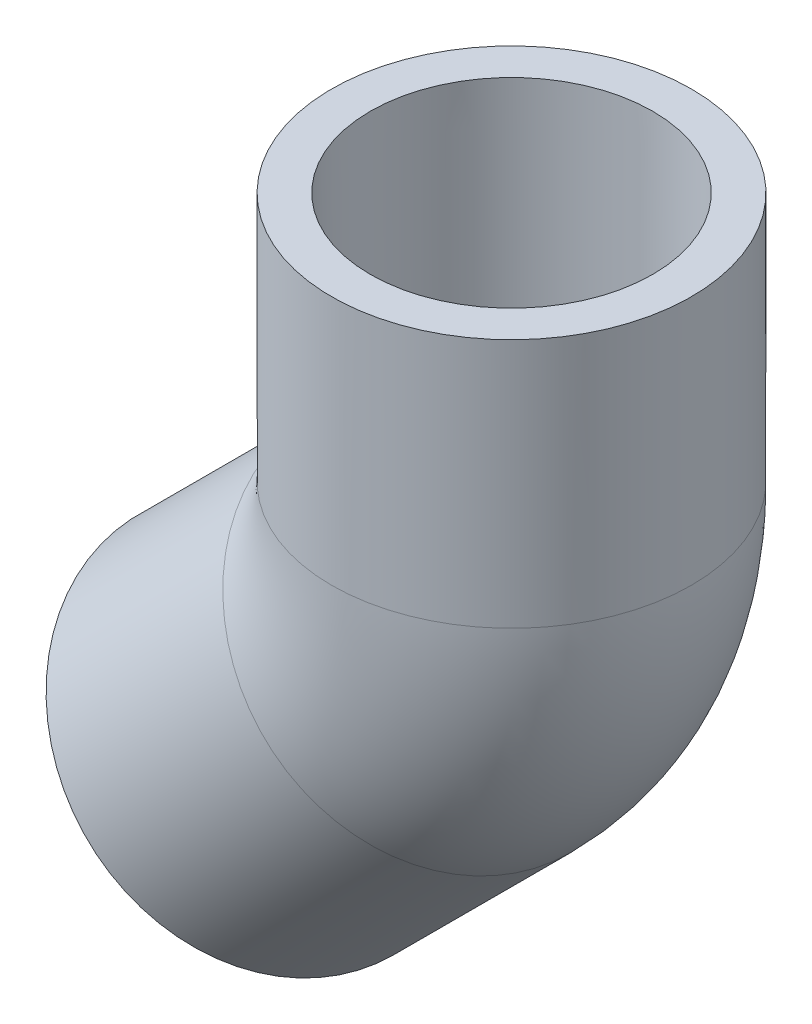
ISO-10303-21;
HEADER;
FILE_DESCRIPTION(('STEP AP214'),'2;1');
FILE_NAME('part.step','',(''),(''),'','','');
FILE_SCHEMA(('AUTOMOTIVE_DESIGN { 1 0 10303 214 1 1 1 1 }'));
ENDSEC;
DATA;
#1=APPLICATION_CONTEXT('core data for automotive mechanical design processes');
#2=APPLICATION_PROTOCOL_DEFINITION('international standard','automotive_design',2000,#1);
#3=PRODUCT_CONTEXT('',#1,'mechanical');
#4=PRODUCT('Part','Part','',(#3));
#5=PRODUCT_RELATED_PRODUCT_CATEGORY('part','',(#4));
#6=PRODUCT_DEFINITION_FORMATION('','',#4);
#7=PRODUCT_DEFINITION_CONTEXT('part definition',#1,'design');
#8=PRODUCT_DEFINITION('design','',#6,#7);
#9=PRODUCT_DEFINITION_SHAPE('','',#8);
#10=(LENGTH_UNIT() NAMED_UNIT(*) SI_UNIT(.MILLI.,.METRE.));
#11=(NAMED_UNIT(*) PLANE_ANGLE_UNIT() SI_UNIT($,.RADIAN.));
#12=(NAMED_UNIT(*) SI_UNIT($,.STERADIAN.) SOLID_ANGLE_UNIT());
#13=UNCERTAINTY_MEASURE_WITH_UNIT(LENGTH_MEASURE(1.E-05),#10,'distance_accuracy_value','');
#14=(GEOMETRIC_REPRESENTATION_CONTEXT(3) GLOBAL_UNCERTAINTY_ASSIGNED_CONTEXT((#13)) GLOBAL_UNIT_ASSIGNED_CONTEXT((#10,
#11,#12)) REPRESENTATION_CONTEXT('',''));
#15=CARTESIAN_POINT('',(0.,0.,0.));
#16=DIRECTION('',(0.,0.,1.));
#17=DIRECTION('',(1.,0.,0.));
#18=AXIS2_PLACEMENT_3D('',#15,#16,#17);
#19=CARTESIAN_POINT('',(-8.9802561210692,-28.3776093425785,0.));
#20=DIRECTION('',(-0.707106781186549,-0.707106781186546,0.));
#21=DIRECTION('',(0.707106781186546,-0.707106781186549,0.));
#22=AXIS2_PLACEMENT_3D('',#19,#20,#21);
#23=PLANE('',#22);
#24=CARTESIAN_POINT('',(-18.6789327318239,-18.6789327318238,0.));
#25=DIRECTION('',(-0.707106781186549,-0.707106781186546,0.));
#26=DIRECTION('',(0.707106781186546,-0.707106781186549,0.));
#27=AXIS2_PLACEMENT_3D('',#24,#25,#26);
#28=CIRCLE('',#27,13.716);
#29=CARTESIAN_POINT('',(-8.9802561210692,-28.3776093425785,0.));
#30=VERTEX_POINT('',#29);
#31=EDGE_CURVE('E49',#30,#30,#28,.T.);
#32=ORIENTED_EDGE('',*,*,#31,.T.);
#33=EDGE_LOOP('',(#32));
#34=FACE_BOUND('',#33,.T.);
#35=CARTESIAN_POINT('',(-18.6789327318239,-18.6789327318238,0.));
#36=DIRECTION('',(-0.707106781186549,-0.707106781186546,0.));
#37=DIRECTION('',(0.707106781186546,-0.707106781186549,0.));
#38=AXIS2_PLACEMENT_3D('',#35,#36,#37);
#39=CIRCLE('',#38,10.7696);
#40=CARTESIAN_POINT('',(-11.0636755411572,-26.2941899224905,0.));
#41=VERTEX_POINT('',#40);
#42=EDGE_CURVE('E36',#41,#41,#39,.T.);
#43=ORIENTED_EDGE('',*,*,#42,.F.);
#44=EDGE_LOOP('',(#43));
#45=FACE_BOUND('',#44,.T.);
#46=ADVANCED_FACE('F30',(#34,#45),#23,.T.);
#47=CARTESIAN_POINT('',(-5.20854855022012,-5.2085485502201,0.));
#48=DIRECTION('',(-0.707106781186549,-0.707106781186546,0.));
#49=DIRECTION('',(0.707106781186546,-0.707106781186549,0.));
#50=AXIS2_PLACEMENT_3D('',#47,#48,#49);
#51=CONICAL_SURFACE('',#50,10.6172,0.00799982933988657);
#52=ORIENTED_EDGE('',*,*,#42,.T.);
#53=EDGE_LOOP('',(#52));
#54=FACE_BOUND('',#53,.T.);
#55=CARTESIAN_POINT('',(-5.20854855022012,-5.2085485502201,0.));
#56=DIRECTION('',(-0.707106781186549,-0.707106781186546,0.));
#57=DIRECTION('',(0.707106781186546,-0.707106781186549,0.));
#58=AXIS2_PLACEMENT_3D('',#55,#56,#57);
#59=CIRCLE('',#58,10.6172);
#60=CARTESIAN_POINT('',(2.29894556699368,-12.7160426674339,0.));
#61=VERTEX_POINT('',#60);
#62=EDGE_CURVE('E40',#61,#61,#59,.T.);
#63=ORIENTED_EDGE('',*,*,#62,.F.);
#64=EDGE_LOOP('',(#63));
#65=FACE_BOUND('',#64,.T.);
#66=ADVANCED_FACE('F81',(#54,#65),#51,.F.);
#67=CARTESIAN_POINT('',(-18.6789327318239,-18.6789327318238,0.));
#68=DIRECTION('',(-0.707106781186549,-0.707106781186546,0.));
#69=DIRECTION('',(0.707106781186546,-0.707106781186549,0.));
#70=AXIS2_PLACEMENT_3D('',#67,#68,#69);
#71=CYLINDRICAL_SURFACE('',#70,13.716);
#72=CARTESIAN_POINT('',(-5.20854855022012,-5.2085485502201,0.));
#73=DIRECTION('',(-0.707106781186549,-0.707106781186546,0.));
#74=DIRECTION('',(0.707106781186546,-0.707106781186549,0.));
#75=AXIS2_PLACEMENT_3D('',#72,#73,#74);
#76=CIRCLE('',#75,13.716);
#77=CARTESIAN_POINT('',(4.49012806053456,-14.9072251609748,0.));
#78=VERTEX_POINT('',#77);
#79=EDGE_CURVE('E44',#78,#78,#76,.T.);
#80=ORIENTED_EDGE('',*,*,#79,.T.);
#81=EDGE_LOOP('',(#80));
#82=FACE_BOUND('',#81,.T.);
#83=ORIENTED_EDGE('',*,*,#31,.F.);
#84=EDGE_LOOP('',(#83));
#85=FACE_BOUND('',#84,.T.);
#86=ADVANCED_FACE('F86',(#82,#85),#71,.T.);
#87=CARTESIAN_POINT('',(-17.7830971004402,7.366,0.));
#88=DIRECTION('',(0.,0.,-1.));
#89=DIRECTION('',(-1.,0.,0.));
#90=AXIS2_PLACEMENT_3D('',#87,#88,#89);
#91=TOROIDAL_SURFACE('',#90,17.7830971004402,7.89939999999997);
#92=CARTESIAN_POINT('',(0.,7.366,0.));
#93=DIRECTION('',(0.,1.,0.));
#94=DIRECTION('',(-1.,0.,0.));
#95=AXIS2_PLACEMENT_3D('',#92,#93,#94);
#96=CIRCLE('',#95,7.89939999999997);
#97=CARTESIAN_POINT('',(7.89939999999997,7.36600000000001,0.));
#98=VERTEX_POINT('',#97);
#99=EDGE_CURVE('E55',#98,#98,#96,.T.);
#100=CARTESIAN_POINT('',(-5.20854855022012,-5.2085485502201,0.));
#101=DIRECTION('',(0.707106781186549,0.707106781186546,0.));
#102=DIRECTION('',(-0.707106781186546,0.707106781186549,0.));
#103=AXIS2_PLACEMENT_3D('',#100,#101,#102);
#104=CIRCLE('',#103,7.89939999999997);
#105=CARTESIAN_POINT('',(0.37717075708487,-10.7942678575251,0.));
#106=VERTEX_POINT('',#105);
#107=EDGE_CURVE('E58',#106,#106,#104,.T.);
#108=CARTESIAN_POINT('',(-17.7830971004402,7.366,0.));
#109=DIRECTION('',(0.,0.,-1.));
#110=DIRECTION('',(-1.,0.,0.));
#111=AXIS2_PLACEMENT_3D('',#108,#109,#110);
#112=CIRCLE('',#111,25.6824971004401);
#113=EDGE_CURVE('',#98,#106,#112,.T.);
#114=ORIENTED_EDGE('',*,*,#99,.T.);
#115=ORIENTED_EDGE('',*,*,#107,.F.);
#116=ORIENTED_EDGE('',*,*,#113,.T.);
#117=ORIENTED_EDGE('',*,*,#113,.F.);
#118=EDGE_LOOP('',(#114,#116,#115,#117));
#119=FACE_BOUND('',#118,.T.);
#120=ADVANCED_FACE('F91',(#119),#91,.F.);
#121=CARTESIAN_POINT('',(-17.7830971004402,7.366,0.));
#122=DIRECTION('',(0.,0.,-1.));
#123=DIRECTION('',(-1.,0.,0.));
#124=AXIS2_PLACEMENT_3D('',#121,#122,#123);
#125=TOROIDAL_SURFACE('',#124,17.7830971004402,13.716);
#126=CARTESIAN_POINT('',(0.,7.366,0.));
#127=DIRECTION('',(0.,1.,0.));
#128=DIRECTION('',(-1.,0.,0.));
#129=AXIS2_PLACEMENT_3D('',#126,#127,#128);
#130=CIRCLE('',#129,13.716);
#131=CARTESIAN_POINT('',(13.716,7.36600000000001,0.));
#132=VERTEX_POINT('',#131);
#133=EDGE_CURVE('E52',#132,#132,#130,.T.);
#134=CARTESIAN_POINT('',(-17.7830971004402,7.366,0.));
#135=DIRECTION('',(0.,0.,-1.));
#136=DIRECTION('',(-1.,0.,0.));
#137=AXIS2_PLACEMENT_3D('',#134,#135,#136);
#138=CIRCLE('',#137,31.4990971004402);
#139=EDGE_CURVE('',#132,#78,#138,.T.);
#140=ORIENTED_EDGE('',*,*,#133,.F.);
#141=ORIENTED_EDGE('',*,*,#79,.F.);
#142=ORIENTED_EDGE('',*,*,#139,.T.);
#143=ORIENTED_EDGE('',*,*,#139,.F.);
#144=EDGE_LOOP('',(#140,#142,#141,#143));
#145=FACE_BOUND('',#144,.T.);
#146=ADVANCED_FACE('F97',(#145),#125,.T.);
#147=CARTESIAN_POINT('',(0.,7.366,0.));
#148=DIRECTION('',(0.,1.,0.));
#149=DIRECTION('',(-1.,0.,0.));
#150=AXIS2_PLACEMENT_3D('',#147,#148,#149);
#151=PLANE('',#150);
#152=CARTESIAN_POINT('',(0.,7.366,0.));
#153=DIRECTION('',(0.,1.,0.));
#154=DIRECTION('',(-1.,0.,0.));
#155=AXIS2_PLACEMENT_3D('',#152,#153,#154);
#156=CIRCLE('',#155,10.6172);
#157=CARTESIAN_POINT('',(-10.6172,7.366,0.));
#158=VERTEX_POINT('',#157);
#159=EDGE_CURVE('E10',#158,#158,#156,.F.);
#160=ORIENTED_EDGE('',*,*,#159,.F.);
#161=EDGE_LOOP('',(#160));
#162=FACE_BOUND('',#161,.T.);
#163=ORIENTED_EDGE('',*,*,#99,.F.);
#164=EDGE_LOOP('',(#163));
#165=FACE_BOUND('',#164,.T.);
#166=ADVANCED_FACE('F100',(#162,#165),#151,.T.);
#167=CARTESIAN_POINT('',(-5.20854855022012,-5.2085485502201,0.));
#168=DIRECTION('',(0.707106781186549,0.707106781186546,0.));
#169=DIRECTION('',(-0.707106781186546,0.707106781186549,0.));
#170=AXIS2_PLACEMENT_3D('',#167,#168,#169);
#171=PLANE('',#170);
#172=ORIENTED_EDGE('',*,*,#62,.T.);
#173=EDGE_LOOP('',(#172));
#174=FACE_BOUND('',#173,.T.);
#175=ORIENTED_EDGE('',*,*,#107,.T.);
#176=EDGE_LOOP('',(#175));
#177=FACE_BOUND('',#176,.T.);
#178=ADVANCED_FACE('F104',(#174,#177),#171,.F.);
#179=CARTESIAN_POINT('',(13.716,26.416,0.));
#180=DIRECTION('',(0.,1.,0.));
#181=DIRECTION('',(0.,0.,1.));
#182=AXIS2_PLACEMENT_3D('',#179,#180,#181);
#183=PLANE('',#182);
#184=CARTESIAN_POINT('',(0.,26.416,0.));
#185=DIRECTION('',(0.,-1.,0.));
#186=DIRECTION('',(0.,0.,-1.));
#187=AXIS2_PLACEMENT_3D('',#184,#185,#186);
#188=CIRCLE('',#187,10.7696);
#189=CARTESIAN_POINT('',(0.,26.416,-10.7696));
#190=VERTEX_POINT('',#189);
#191=EDGE_CURVE('E64',#190,#190,#188,.T.);
#192=ORIENTED_EDGE('',*,*,#191,.T.);
#193=EDGE_LOOP('',(#192));
#194=FACE_BOUND('',#193,.T.);
#195=CARTESIAN_POINT('',(0.,26.416,0.));
#196=DIRECTION('',(0.,-1.,0.));
#197=DIRECTION('',(0.,0.,-1.));
#198=AXIS2_PLACEMENT_3D('',#195,#196,#197);
#199=CIRCLE('',#198,13.716);
#200=CARTESIAN_POINT('',(0.,26.416,-13.716));
#201=VERTEX_POINT('',#200);
#202=EDGE_CURVE('E61',#201,#201,#199,.T.);
#203=ORIENTED_EDGE('',*,*,#202,.F.);
#204=EDGE_LOOP('',(#203));
#205=FACE_BOUND('',#204,.T.);
#206=ADVANCED_FACE('F68',(#194,#205),#183,.T.);
#207=CARTESIAN_POINT('',(0.,0.,0.));
#208=DIRECTION('',(0.,-1.,0.));
#209=DIRECTION('',(0.,0.,-1.));
#210=AXIS2_PLACEMENT_3D('',#207,#208,#209);
#211=CYLINDRICAL_SURFACE('',#210,13.716);
#212=ORIENTED_EDGE('',*,*,#202,.T.);
#213=EDGE_LOOP('',(#212));
#214=FACE_BOUND('',#213,.T.);
#215=ORIENTED_EDGE('',*,*,#133,.T.);
#216=EDGE_LOOP('',(#215));
#217=FACE_BOUND('',#216,.T.);
#218=ADVANCED_FACE('F73',(#214,#217),#211,.T.);
#219=CARTESIAN_POINT('',(0.,26.416,0.));
#220=DIRECTION('',(0.,1.,0.));
#221=DIRECTION('',(0.,0.,1.));
#222=AXIS2_PLACEMENT_3D('',#219,#220,#221);
#223=CONICAL_SURFACE('',#222,10.7696,0.00799982933988666);
#224=ORIENTED_EDGE('',*,*,#159,.T.);
#225=EDGE_LOOP('',(#224));
#226=FACE_BOUND('',#225,.T.);
#227=ORIENTED_EDGE('',*,*,#191,.F.);
#228=EDGE_LOOP('',(#227));
#229=FACE_BOUND('',#228,.T.);
#230=ADVANCED_FACE('F71',(#226,#229),#223,.F.);
#231=CLOSED_SHELL('',(#46,#66,#86,#120,#146,#166,#178,#206,#218,#230));
#232=MANIFOLD_SOLID_BREP('B2',#231);
#233=ADVANCED_BREP_SHAPE_REPRESENTATION('',(#18,#232),#14);
#234=SHAPE_DEFINITION_REPRESENTATION(#9,#233);
ENDSEC;
END-ISO-10303-21;
